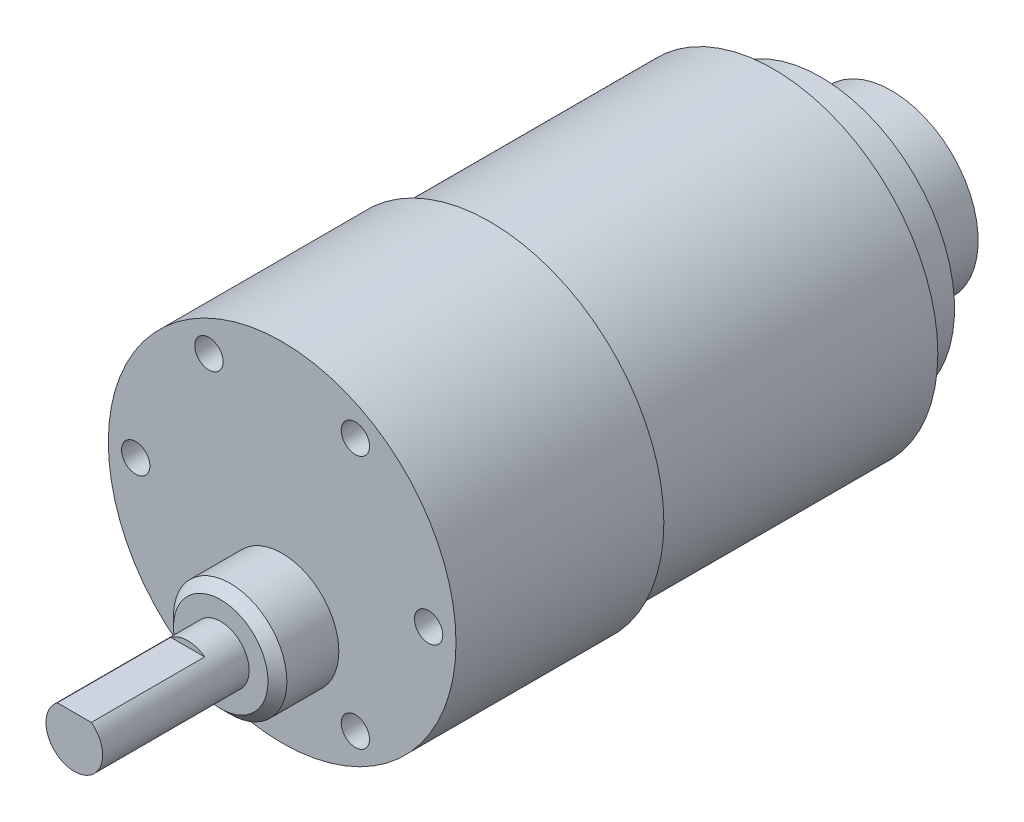
ISO-10303-21;
HEADER;
FILE_DESCRIPTION(('STEP AP214'),'2;1');
FILE_NAME('part.step','',(''),(''),'','','');
FILE_SCHEMA(('AUTOMOTIVE_DESIGN { 1 0 10303 214 1 1 1 1 }'));
ENDSEC;
DATA;
#1=APPLICATION_CONTEXT('core data for automotive mechanical design processes');
#2=APPLICATION_PROTOCOL_DEFINITION('international standard','automotive_design',2000,#1);
#3=PRODUCT_CONTEXT('',#1,'mechanical');
#4=PRODUCT('Part','Part','',(#3));
#5=PRODUCT_RELATED_PRODUCT_CATEGORY('part','',(#4));
#6=PRODUCT_DEFINITION_FORMATION('','',#4);
#7=PRODUCT_DEFINITION_CONTEXT('part definition',#1,'design');
#8=PRODUCT_DEFINITION('design','',#6,#7);
#9=PRODUCT_DEFINITION_SHAPE('','',#8);
#10=(LENGTH_UNIT() NAMED_UNIT(*) SI_UNIT(.MILLI.,.METRE.));
#11=(NAMED_UNIT(*) PLANE_ANGLE_UNIT() SI_UNIT($,.RADIAN.));
#12=(NAMED_UNIT(*) SI_UNIT($,.STERADIAN.) SOLID_ANGLE_UNIT());
#13=UNCERTAINTY_MEASURE_WITH_UNIT(LENGTH_MEASURE(1.E-05),#10,'distance_accuracy_value','');
#14=(GEOMETRIC_REPRESENTATION_CONTEXT(3) GLOBAL_UNCERTAINTY_ASSIGNED_CONTEXT((#13)) GLOBAL_UNIT_ASSIGNED_CONTEXT((#10,
#11,#12)) REPRESENTATION_CONTEXT('',''));
#15=CARTESIAN_POINT('',(0.,0.,0.));
#16=DIRECTION('',(0.,0.,1.));
#17=DIRECTION('',(1.,0.,0.));
#18=AXIS2_PLACEMENT_3D('',#15,#16,#17);
#19=CARTESIAN_POINT('',(0.,0.,-30.));
#20=DIRECTION('',(0.,0.,-1.));
#21=DIRECTION('',(-1.,0.,0.));
#22=AXIS2_PLACEMENT_3D('',#19,#20,#21);
#23=PLANE('',#22);
#24=CARTESIAN_POINT('',(0.,0.,-30.));
#25=DIRECTION('',(0.,0.,-1.));
#26=DIRECTION('',(-1.,0.,0.));
#27=AXIS2_PLACEMENT_3D('',#24,#25,#26);
#28=CIRCLE('',#27,17.4);
#29=CARTESIAN_POINT('',(-17.4,0.,-30.));
#30=VERTEX_POINT('',#29);
#31=EDGE_CURVE('E78',#30,#30,#28,.T.);
#32=ORIENTED_EDGE('',*,*,#31,.T.);
#33=EDGE_LOOP('',(#32));
#34=FACE_BOUND('',#33,.T.);
#35=CARTESIAN_POINT('',(0.,0.,-30.));
#36=DIRECTION('',(0.,0.,-1.));
#37=DIRECTION('',(-1.,0.,0.));
#38=AXIS2_PLACEMENT_3D('',#35,#36,#37);
#39=CIRCLE('',#38,14.1682647847948);
#40=CARTESIAN_POINT('',(-14.1682647847948,0.,-30.));
#41=VERTEX_POINT('',#40);
#42=EDGE_CURVE('E398',#41,#41,#39,.T.);
#43=ORIENTED_EDGE('',*,*,#42,.F.);
#44=EDGE_LOOP('',(#43));
#45=FACE_BOUND('',#44,.T.);
#46=ADVANCED_FACE('F35',(#34,#45),#23,.T.);
#47=CARTESIAN_POINT('',(0.,-7.,44.));
#48=DIRECTION('',(0.,0.,-1.));
#49=DIRECTION('',(-1.,0.,0.));
#50=AXIS2_PLACEMENT_3D('',#47,#48,#49);
#51=CYLINDRICAL_SURFACE('',#50,3.);
#52=CARTESIAN_POINT('',(0.,-7.,28.5));
#53=DIRECTION('',(0.,0.,1.));
#54=DIRECTION('',(1.,0.,0.));
#55=AXIS2_PLACEMENT_3D('',#52,#53,#54);
#56=CIRCLE('',#55,3.);
#57=CARTESIAN_POINT('',(3.,-7.,28.5));
#58=VERTEX_POINT('',#57);
#59=EDGE_CURVE('E72',#58,#58,#56,.T.);
#60=ORIENTED_EDGE('',*,*,#59,.T.);
#61=EDGE_LOOP('',(#60));
#62=FACE_BOUND('',#61,.T.);
#63=DIRECTION('',(0.,0.,-1.));
#64=VECTOR('',#63,1.);
#65=CARTESIAN_POINT('',(1.8,-4.6,44.));
#66=LINE('',#65,#64);
#67=CARTESIAN_POINT('',(1.8,-4.6,44.));
#68=VERTEX_POINT('',#67);
#69=CARTESIAN_POINT('',(1.8,-4.6,32.));
#70=VERTEX_POINT('',#69);
#71=EDGE_CURVE('E63',#68,#70,#66,.T.);
#72=ORIENTED_EDGE('',*,*,#71,.F.);
#73=CARTESIAN_POINT('',(0.,-7.,44.));
#74=DIRECTION('',(0.,0.,1.));
#75=DIRECTION('',(1.,0.,0.));
#76=AXIS2_PLACEMENT_3D('',#73,#74,#75);
#77=CIRCLE('',#76,3.);
#78=CARTESIAN_POINT('',(-1.8,-4.6,44.));
#79=VERTEX_POINT('',#78);
#80=EDGE_CURVE('E71',#79,#68,#77,.T.);
#81=ORIENTED_EDGE('',*,*,#80,.F.);
#82=DIRECTION('',(0.,0.,-1.));
#83=VECTOR('',#82,1.);
#84=CARTESIAN_POINT('',(-1.8,-4.6,44.));
#85=LINE('',#84,#83);
#86=CARTESIAN_POINT('',(-1.8,-4.6,32.));
#87=VERTEX_POINT('',#86);
#88=EDGE_CURVE('E51',#87,#79,#85,.F.);
#89=ORIENTED_EDGE('',*,*,#88,.F.);
#90=CARTESIAN_POINT('',(0.,-7.,32.));
#91=DIRECTION('',(0.,0.,1.));
#92=DIRECTION('',(1.,0.,0.));
#93=AXIS2_PLACEMENT_3D('',#90,#91,#92);
#94=CIRCLE('',#93,3.);
#95=EDGE_CURVE('E11',#70,#87,#94,.T.);
#96=ORIENTED_EDGE('',*,*,#95,.F.);
#97=EDGE_LOOP('',(#72,#81,#89,#96));
#98=FACE_BOUND('',#97,.T.);
#99=ADVANCED_FACE('F70',(#62,#98),#51,.T.);
#100=CARTESIAN_POINT('',(0.,-7.,44.));
#101=DIRECTION('',(0.,0.,1.));
#102=DIRECTION('',(1.,0.,0.));
#103=AXIS2_PLACEMENT_3D('',#100,#101,#102);
#104=PLANE('',#103);
#105=ORIENTED_EDGE('',*,*,#80,.T.);
#106=DIRECTION('',(-1.,0.,0.));
#107=VECTOR('',#106,1.);
#108=CARTESIAN_POINT('',(0.,-4.6,44.));
#109=LINE('',#108,#107);
#110=EDGE_CURVE('E44',#68,#79,#109,.T.);
#111=ORIENTED_EDGE('',*,*,#110,.T.);
#112=EDGE_LOOP('',(#105,#111));
#113=FACE_BOUND('',#112,.T.);
#114=ADVANCED_FACE('F74',(#113),#104,.T.);
#115=CARTESIAN_POINT('',(0.,-7.,28.5));
#116=DIRECTION('',(0.,0.,1.));
#117=DIRECTION('',(1.,0.,0.));
#118=AXIS2_PLACEMENT_3D('',#115,#116,#117);
#119=PLANE('',#118);
#120=CARTESIAN_POINT('',(0.,-7.,28.5));
#121=DIRECTION('',(0.,0.,1.));
#122=DIRECTION('',(1.,0.,0.));
#123=AXIS2_PLACEMENT_3D('',#120,#121,#122);
#124=CIRCLE('',#123,5.00000000000005);
#125=CARTESIAN_POINT('',(5.00000000000005,-7.,28.5));
#126=VERTEX_POINT('',#125);
#127=EDGE_CURVE('E95',#126,#126,#124,.T.);
#128=ORIENTED_EDGE('',*,*,#127,.T.);
#129=EDGE_LOOP('',(#128));
#130=FACE_BOUND('',#129,.T.);
#131=ORIENTED_EDGE('',*,*,#59,.F.);
#132=EDGE_LOOP('',(#131));
#133=FACE_BOUND('',#132,.T.);
#134=ADVANCED_FACE('F109',(#130,#133),#119,.T.);
#135=CARTESIAN_POINT('',(0.,0.,22.));
#136=DIRECTION('',(0.,0.,1.));
#137=DIRECTION('',(1.,0.,0.));
#138=AXIS2_PLACEMENT_3D('',#135,#136,#137);
#139=PLANE('',#138);
#140=CARTESIAN_POINT('',(7.75,-13.4233937586588,22.));
#141=DIRECTION('',(0.,0.,1.));
#142=DIRECTION('',(1.,0.,0.));
#143=AXIS2_PLACEMENT_3D('',#140,#141,#142);
#144=CIRCLE('',#143,1.5);
#145=CARTESIAN_POINT('',(9.25,-13.4233937586588,22.));
#146=VERTEX_POINT('',#145);
#147=EDGE_CURVE('E390',#146,#146,#144,.T.);
#148=ORIENTED_EDGE('',*,*,#147,.F.);
#149=EDGE_LOOP('',(#148));
#150=FACE_BOUND('',#149,.T.);
#151=CARTESIAN_POINT('',(-7.75,-13.4233937586588,22.));
#152=DIRECTION('',(0.,0.,1.));
#153=DIRECTION('',(1.,0.,0.));
#154=AXIS2_PLACEMENT_3D('',#151,#152,#153);
#155=CIRCLE('',#154,1.5);
#156=CARTESIAN_POINT('',(-6.25,-13.4233937586588,22.));
#157=VERTEX_POINT('',#156);
#158=EDGE_CURVE('E401',#157,#157,#155,.T.);
#159=ORIENTED_EDGE('',*,*,#158,.F.);
#160=EDGE_LOOP('',(#159));
#161=FACE_BOUND('',#160,.T.);
#162=CARTESIAN_POINT('',(-15.5,0.,22.));
#163=DIRECTION('',(0.,0.,1.));
#164=DIRECTION('',(1.,0.,0.));
#165=AXIS2_PLACEMENT_3D('',#162,#163,#164);
#166=CIRCLE('',#165,1.5);
#167=CARTESIAN_POINT('',(-14.,0.,22.));
#168=VERTEX_POINT('',#167);
#169=EDGE_CURVE('E406',#168,#168,#166,.T.);
#170=ORIENTED_EDGE('',*,*,#169,.F.);
#171=EDGE_LOOP('',(#170));
#172=FACE_BOUND('',#171,.T.);
#173=CARTESIAN_POINT('',(15.5,0.,22.));
#174=DIRECTION('',(0.,0.,1.));
#175=DIRECTION('',(1.,0.,0.));
#176=AXIS2_PLACEMENT_3D('',#173,#174,#175);
#177=CIRCLE('',#176,1.5);
#178=CARTESIAN_POINT('',(17.,0.,22.));
#179=VERTEX_POINT('',#178);
#180=EDGE_CURVE('E412',#179,#179,#177,.T.);
#181=ORIENTED_EDGE('',*,*,#180,.F.);
#182=EDGE_LOOP('',(#181));
#183=FACE_BOUND('',#182,.T.);
#184=CARTESIAN_POINT('',(7.75,13.4233937586588,22.));
#185=DIRECTION('',(0.,0.,1.));
#186=DIRECTION('',(1.,0.,0.));
#187=AXIS2_PLACEMENT_3D('',#184,#185,#186);
#188=CIRCLE('',#187,1.5);
#189=CARTESIAN_POINT('',(9.25,13.4233937586588,22.));
#190=VERTEX_POINT('',#189);
#191=EDGE_CURVE('E418',#190,#190,#188,.T.);
#192=ORIENTED_EDGE('',*,*,#191,.F.);
#193=EDGE_LOOP('',(#192));
#194=FACE_BOUND('',#193,.T.);
#195=CARTESIAN_POINT('',(-7.75,13.4233937586588,22.));
#196=DIRECTION('',(0.,0.,1.));
#197=DIRECTION('',(1.,0.,0.));
#198=AXIS2_PLACEMENT_3D('',#195,#196,#197);
#199=CIRCLE('',#198,1.5);
#200=CARTESIAN_POINT('',(-6.25,13.4233937586588,22.));
#201=VERTEX_POINT('',#200);
#202=EDGE_CURVE('E424',#201,#201,#199,.T.);
#203=ORIENTED_EDGE('',*,*,#202,.F.);
#204=EDGE_LOOP('',(#203));
#205=FACE_BOUND('',#204,.T.);
#206=CARTESIAN_POINT('',(0.,0.,22.));
#207=DIRECTION('',(0.,0.,1.));
#208=DIRECTION('',(1.,0.,0.));
#209=AXIS2_PLACEMENT_3D('',#206,#207,#208);
#210=CIRCLE('',#209,18.4);
#211=CARTESIAN_POINT('',(18.4,0.,22.));
#212=VERTEX_POINT('',#211);
#213=EDGE_CURVE('E87',#212,#212,#210,.T.);
#214=ORIENTED_EDGE('',*,*,#213,.T.);
#215=EDGE_LOOP('',(#214));
#216=FACE_BOUND('',#215,.T.);
#217=CARTESIAN_POINT('',(0.,-7.,22.));
#218=DIRECTION('',(0.,0.,1.));
#219=DIRECTION('',(1.,0.,0.));
#220=AXIS2_PLACEMENT_3D('',#217,#218,#219);
#221=CIRCLE('',#220,6.);
#222=CARTESIAN_POINT('',(6.,-7.,22.));
#223=VERTEX_POINT('',#222);
#224=EDGE_CURVE('E75',#223,#223,#221,.T.);
#225=ORIENTED_EDGE('',*,*,#224,.F.);
#226=EDGE_LOOP('',(#225));
#227=FACE_BOUND('',#226,.T.);
#228=ADVANCED_FACE('F112',(#150,#161,#172,#183,#194,#205,#216,#227),#139,.T.);
#229=CARTESIAN_POINT('',(0.,0.,0.));
#230=DIRECTION('',(0.,0.,1.));
#231=DIRECTION('',(1.,0.,0.));
#232=AXIS2_PLACEMENT_3D('',#229,#230,#231);
#233=PLANE('',#232);
#234=CARTESIAN_POINT('',(0.,0.,0.));
#235=DIRECTION('',(0.,0.,1.));
#236=DIRECTION('',(1.,0.,0.));
#237=AXIS2_PLACEMENT_3D('',#234,#235,#236);
#238=CIRCLE('',#237,18.4);
#239=CARTESIAN_POINT('',(18.4,0.,0.));
#240=VERTEX_POINT('',#239);
#241=EDGE_CURVE('E86',#240,#240,#238,.T.);
#242=ORIENTED_EDGE('',*,*,#241,.F.);
#243=EDGE_LOOP('',(#242));
#244=FACE_BOUND('',#243,.T.);
#245=CARTESIAN_POINT('',(0.,0.,0.));
#246=DIRECTION('',(0.,0.,1.));
#247=DIRECTION('',(1.,0.,0.));
#248=AXIS2_PLACEMENT_3D('',#245,#246,#247);
#249=CIRCLE('',#248,17.4);
#250=CARTESIAN_POINT('',(17.4,0.,0.));
#251=VERTEX_POINT('',#250);
#252=EDGE_CURVE('E90',#251,#251,#249,.F.);
#253=ORIENTED_EDGE('',*,*,#252,.F.);
#254=EDGE_LOOP('',(#253));
#255=FACE_BOUND('',#254,.T.);
#256=ADVANCED_FACE('F136',(#244,#255),#233,.F.);
#257=CARTESIAN_POINT('',(0.,0.,22.));
#258=DIRECTION('',(0.,0.,-1.));
#259=DIRECTION('',(-1.,0.,0.));
#260=AXIS2_PLACEMENT_3D('',#257,#258,#259);
#261=CYLINDRICAL_SURFACE('',#260,18.4);
#262=ORIENTED_EDGE('',*,*,#213,.F.);
#263=EDGE_LOOP('',(#262));
#264=FACE_BOUND('',#263,.T.);
#265=ORIENTED_EDGE('',*,*,#241,.T.);
#266=EDGE_LOOP('',(#265));
#267=FACE_BOUND('',#266,.T.);
#268=ADVANCED_FACE('F132',(#264,#267),#261,.T.);
#269=CARTESIAN_POINT('',(0.,0.,-30.));
#270=DIRECTION('',(0.,0.,1.));
#271=DIRECTION('',(1.,0.,0.));
#272=AXIS2_PLACEMENT_3D('',#269,#270,#271);
#273=CYLINDRICAL_SURFACE('',#272,17.4);
#274=ORIENTED_EDGE('',*,*,#31,.F.);
#275=EDGE_LOOP('',(#274));
#276=FACE_BOUND('',#275,.T.);
#277=ORIENTED_EDGE('',*,*,#252,.T.);
#278=EDGE_LOOP('',(#277));
#279=FACE_BOUND('',#278,.T.);
#280=ADVANCED_FACE('F128',(#276,#279),#273,.T.);
#281=CARTESIAN_POINT('',(0.,-7.,28.5));
#282=DIRECTION('',(0.,0.,-1.));
#283=DIRECTION('',(-1.,0.,0.));
#284=AXIS2_PLACEMENT_3D('',#281,#282,#283);
#285=CYLINDRICAL_SURFACE('',#284,6.);
#286=CARTESIAN_POINT('',(0.,-7.,27.5));
#287=DIRECTION('',(0.,0.,1.));
#288=DIRECTION('',(1.,0.,0.));
#289=AXIS2_PLACEMENT_3D('',#286,#287,#288);
#290=CIRCLE('',#289,6.);
#291=CARTESIAN_POINT('',(6.,-7.,27.5));
#292=VERTEX_POINT('',#291);
#293=EDGE_CURVE('E67',#292,#292,#290,.F.);
#294=ORIENTED_EDGE('',*,*,#293,.T.);
#295=EDGE_LOOP('',(#294));
#296=FACE_BOUND('',#295,.T.);
#297=ORIENTED_EDGE('',*,*,#224,.T.);
#298=EDGE_LOOP('',(#297));
#299=FACE_BOUND('',#298,.T.);
#300=ADVANCED_FACE('F101',(#296,#299),#285,.T.);
#301=CARTESIAN_POINT('',(0.,-7.,28.5));
#302=DIRECTION('',(0.,0.,-1.));
#303=DIRECTION('',(-1.,0.,0.));
#304=AXIS2_PLACEMENT_3D('',#301,#302,#303);
#305=CONICAL_SURFACE('',#304,5.00000000000005,0.785398163397445);
#306=ORIENTED_EDGE('',*,*,#293,.F.);
#307=EDGE_LOOP('',(#306));
#308=FACE_BOUND('',#307,.T.);
#309=ORIENTED_EDGE('',*,*,#127,.F.);
#310=EDGE_LOOP('',(#309));
#311=FACE_BOUND('',#310,.T.);
#312=ADVANCED_FACE('F37',(#308,#311),#305,.T.);
#313=CARTESIAN_POINT('',(15.5,-4.,32.));
#314=DIRECTION('',(0.,0.,1.));
#315=DIRECTION('',(1.,0.,0.));
#316=AXIS2_PLACEMENT_3D('',#313,#314,#315);
#317=PLANE('',#316);
#318=DIRECTION('',(-1.,0.,0.));
#319=VECTOR('',#318,1.);
#320=CARTESIAN_POINT('',(15.5,-4.6,32.));
#321=LINE('',#320,#319);
#322=EDGE_CURVE('E430',#70,#87,#321,.T.);
#323=ORIENTED_EDGE('',*,*,#322,.F.);
#324=ORIENTED_EDGE('',*,*,#95,.T.);
#325=EDGE_LOOP('',(#323,#324));
#326=FACE_BOUND('',#325,.T.);
#327=ADVANCED_FACE('F106',(#326),#317,.T.);
#328=CARTESIAN_POINT('',(15.5,-4.6,44.));
#329=DIRECTION('',(0.,1.,0.));
#330=DIRECTION('',(0.,0.,1.));
#331=AXIS2_PLACEMENT_3D('',#328,#329,#330);
#332=PLANE('',#331);
#333=ORIENTED_EDGE('',*,*,#71,.T.);
#334=ORIENTED_EDGE('',*,*,#322,.T.);
#335=ORIENTED_EDGE('',*,*,#88,.T.);
#336=ORIENTED_EDGE('',*,*,#110,.F.);
#337=EDGE_LOOP('',(#333,#334,#335,#336));
#338=FACE_BOUND('',#337,.T.);
#339=ADVANCED_FACE('F62',(#338),#332,.T.);
#340=CARTESIAN_POINT('',(-7.75,13.4233937586588,17.));
#341=DIRECTION('',(0.,0.,1.));
#342=DIRECTION('',(1.,0.,0.));
#343=AXIS2_PLACEMENT_3D('',#340,#341,#342);
#344=CYLINDRICAL_SURFACE('',#343,1.5);
#345=CARTESIAN_POINT('',(-7.75,13.4233937586588,17.));
#346=DIRECTION('',(0.,0.,1.));
#347=DIRECTION('',(1.,0.,0.));
#348=AXIS2_PLACEMENT_3D('',#345,#346,#347);
#349=CIRCLE('',#348,1.5);
#350=CARTESIAN_POINT('',(-6.25,13.4233937586588,17.));
#351=VERTEX_POINT('',#350);
#352=EDGE_CURVE('E427',#351,#351,#349,.T.);
#353=ORIENTED_EDGE('',*,*,#352,.F.);
#354=EDGE_LOOP('',(#353));
#355=FACE_BOUND('',#354,.T.);
#356=ORIENTED_EDGE('',*,*,#202,.T.);
#357=EDGE_LOOP('',(#356));
#358=FACE_BOUND('',#357,.T.);
#359=ADVANCED_FACE('F181',(#355,#358),#344,.F.);
#360=CARTESIAN_POINT('',(-7.75,13.4233937586588,17.));
#361=DIRECTION('',(0.,0.,1.));
#362=DIRECTION('',(1.,0.,0.));
#363=AXIS2_PLACEMENT_3D('',#360,#361,#362);
#364=PLANE('',#363);
#365=ORIENTED_EDGE('',*,*,#352,.T.);
#366=EDGE_LOOP('',(#365));
#367=FACE_BOUND('',#366,.T.);
#368=ADVANCED_FACE('F188',(#367),#364,.T.);
#369=CARTESIAN_POINT('',(7.75,13.4233937586588,17.));
#370=DIRECTION('',(0.,0.,1.));
#371=DIRECTION('',(1.,0.,0.));
#372=AXIS2_PLACEMENT_3D('',#369,#370,#371);
#373=CYLINDRICAL_SURFACE('',#372,1.5);
#374=CARTESIAN_POINT('',(7.75,13.4233937586588,17.));
#375=DIRECTION('',(0.,0.,1.));
#376=DIRECTION('',(1.,0.,0.));
#377=AXIS2_PLACEMENT_3D('',#374,#375,#376);
#378=CIRCLE('',#377,1.5);
#379=CARTESIAN_POINT('',(9.25,13.4233937586588,17.));
#380=VERTEX_POINT('',#379);
#381=EDGE_CURVE('E421',#380,#380,#378,.T.);
#382=ORIENTED_EDGE('',*,*,#381,.F.);
#383=EDGE_LOOP('',(#382));
#384=FACE_BOUND('',#383,.T.);
#385=ORIENTED_EDGE('',*,*,#191,.T.);
#386=EDGE_LOOP('',(#385));
#387=FACE_BOUND('',#386,.T.);
#388=ADVANCED_FACE('F196',(#384,#387),#373,.F.);
#389=CARTESIAN_POINT('',(7.75,13.4233937586588,17.));
#390=DIRECTION('',(0.,0.,1.));
#391=DIRECTION('',(1.,0.,0.));
#392=AXIS2_PLACEMENT_3D('',#389,#390,#391);
#393=PLANE('',#392);
#394=ORIENTED_EDGE('',*,*,#381,.T.);
#395=EDGE_LOOP('',(#394));
#396=FACE_BOUND('',#395,.T.);
#397=ADVANCED_FACE('F204',(#396),#393,.T.);
#398=CARTESIAN_POINT('',(15.5,0.,17.));
#399=DIRECTION('',(0.,0.,1.));
#400=DIRECTION('',(1.,0.,0.));
#401=AXIS2_PLACEMENT_3D('',#398,#399,#400);
#402=CYLINDRICAL_SURFACE('',#401,1.5);
#403=CARTESIAN_POINT('',(15.5,0.,17.));
#404=DIRECTION('',(0.,0.,1.));
#405=DIRECTION('',(1.,0.,0.));
#406=AXIS2_PLACEMENT_3D('',#403,#404,#405);
#407=CIRCLE('',#406,1.5);
#408=CARTESIAN_POINT('',(17.,0.,17.));
#409=VERTEX_POINT('',#408);
#410=EDGE_CURVE('E415',#409,#409,#407,.T.);
#411=ORIENTED_EDGE('',*,*,#410,.F.);
#412=EDGE_LOOP('',(#411));
#413=FACE_BOUND('',#412,.T.);
#414=ORIENTED_EDGE('',*,*,#180,.T.);
#415=EDGE_LOOP('',(#414));
#416=FACE_BOUND('',#415,.T.);
#417=ADVANCED_FACE('F212',(#413,#416),#402,.F.);
#418=CARTESIAN_POINT('',(15.5,0.,17.));
#419=DIRECTION('',(0.,0.,1.));
#420=DIRECTION('',(1.,0.,0.));
#421=AXIS2_PLACEMENT_3D('',#418,#419,#420);
#422=PLANE('',#421);
#423=ORIENTED_EDGE('',*,*,#410,.T.);
#424=EDGE_LOOP('',(#423));
#425=FACE_BOUND('',#424,.T.);
#426=ADVANCED_FACE('F220',(#425),#422,.T.);
#427=CARTESIAN_POINT('',(-15.5,0.,17.));
#428=DIRECTION('',(0.,0.,1.));
#429=DIRECTION('',(1.,0.,0.));
#430=AXIS2_PLACEMENT_3D('',#427,#428,#429);
#431=CYLINDRICAL_SURFACE('',#430,1.5);
#432=CARTESIAN_POINT('',(-15.5,0.,17.));
#433=DIRECTION('',(0.,0.,1.));
#434=DIRECTION('',(1.,0.,0.));
#435=AXIS2_PLACEMENT_3D('',#432,#433,#434);
#436=CIRCLE('',#435,1.5);
#437=CARTESIAN_POINT('',(-14.,0.,17.));
#438=VERTEX_POINT('',#437);
#439=EDGE_CURVE('E409',#438,#438,#436,.T.);
#440=ORIENTED_EDGE('',*,*,#439,.F.);
#441=EDGE_LOOP('',(#440));
#442=FACE_BOUND('',#441,.T.);
#443=ORIENTED_EDGE('',*,*,#169,.T.);
#444=EDGE_LOOP('',(#443));
#445=FACE_BOUND('',#444,.T.);
#446=ADVANCED_FACE('F228',(#442,#445),#431,.F.);
#447=CARTESIAN_POINT('',(-15.5,0.,17.));
#448=DIRECTION('',(0.,0.,1.));
#449=DIRECTION('',(1.,0.,0.));
#450=AXIS2_PLACEMENT_3D('',#447,#448,#449);
#451=PLANE('',#450);
#452=ORIENTED_EDGE('',*,*,#439,.T.);
#453=EDGE_LOOP('',(#452));
#454=FACE_BOUND('',#453,.T.);
#455=ADVANCED_FACE('F236',(#454),#451,.T.);
#456=CARTESIAN_POINT('',(-7.75,-13.4233937586588,17.));
#457=DIRECTION('',(0.,0.,1.));
#458=DIRECTION('',(1.,0.,0.));
#459=AXIS2_PLACEMENT_3D('',#456,#457,#458);
#460=CYLINDRICAL_SURFACE('',#459,1.5);
#461=CARTESIAN_POINT('',(-7.75,-13.4233937586588,17.));
#462=DIRECTION('',(0.,0.,1.));
#463=DIRECTION('',(1.,0.,0.));
#464=AXIS2_PLACEMENT_3D('',#461,#462,#463);
#465=CIRCLE('',#464,1.5);
#466=CARTESIAN_POINT('',(-6.25,-13.4233937586588,17.));
#467=VERTEX_POINT('',#466);
#468=EDGE_CURVE('E403',#467,#467,#465,.T.);
#469=ORIENTED_EDGE('',*,*,#468,.F.);
#470=EDGE_LOOP('',(#469));
#471=FACE_BOUND('',#470,.T.);
#472=ORIENTED_EDGE('',*,*,#158,.T.);
#473=EDGE_LOOP('',(#472));
#474=FACE_BOUND('',#473,.T.);
#475=ADVANCED_FACE('F244',(#471,#474),#460,.F.);
#476=CARTESIAN_POINT('',(-7.75,-13.4233937586588,17.));
#477=DIRECTION('',(0.,0.,1.));
#478=DIRECTION('',(1.,0.,0.));
#479=AXIS2_PLACEMENT_3D('',#476,#477,#478);
#480=PLANE('',#479);
#481=ORIENTED_EDGE('',*,*,#468,.T.);
#482=EDGE_LOOP('',(#481));
#483=FACE_BOUND('',#482,.T.);
#484=ADVANCED_FACE('F252',(#483),#480,.T.);
#485=CARTESIAN_POINT('',(7.75,-13.4233937586588,17.));
#486=DIRECTION('',(0.,0.,1.));
#487=DIRECTION('',(1.,0.,0.));
#488=AXIS2_PLACEMENT_3D('',#485,#486,#487);
#489=CYLINDRICAL_SURFACE('',#488,1.5);
#490=CARTESIAN_POINT('',(7.75,-13.4233937586588,17.));
#491=DIRECTION('',(0.,0.,1.));
#492=DIRECTION('',(1.,0.,0.));
#493=AXIS2_PLACEMENT_3D('',#490,#491,#492);
#494=CIRCLE('',#493,1.5);
#495=CARTESIAN_POINT('',(9.25,-13.4233937586588,17.));
#496=VERTEX_POINT('',#495);
#497=EDGE_CURVE('E393',#496,#496,#494,.T.);
#498=ORIENTED_EDGE('',*,*,#497,.F.);
#499=EDGE_LOOP('',(#498));
#500=FACE_BOUND('',#499,.T.);
#501=ORIENTED_EDGE('',*,*,#147,.T.);
#502=EDGE_LOOP('',(#501));
#503=FACE_BOUND('',#502,.T.);
#504=ADVANCED_FACE('F260',(#500,#503),#489,.F.);
#505=CARTESIAN_POINT('',(7.75,-13.4233937586588,17.));
#506=DIRECTION('',(0.,0.,1.));
#507=DIRECTION('',(1.,0.,0.));
#508=AXIS2_PLACEMENT_3D('',#505,#506,#507);
#509=PLANE('',#508);
#510=ORIENTED_EDGE('',*,*,#497,.T.);
#511=EDGE_LOOP('',(#510));
#512=FACE_BOUND('',#511,.T.);
#513=ADVANCED_FACE('F268',(#512),#509,.T.);
#514=CARTESIAN_POINT('',(0.,0.,-35.));
#515=DIRECTION('',(0.,0.,-1.));
#516=DIRECTION('',(-1.,0.,0.));
#517=AXIS2_PLACEMENT_3D('',#514,#515,#516);
#518=PLANE('',#517);
#519=CARTESIAN_POINT('',(0.,0.,-35.));
#520=DIRECTION('',(0.,0.,-1.));
#521=DIRECTION('',(-1.,0.,0.));
#522=AXIS2_PLACEMENT_3D('',#519,#520,#521);
#523=CIRCLE('',#522,14.1682647847948);
#524=CARTESIAN_POINT('',(-14.1682647847948,0.,-35.));
#525=VERTEX_POINT('',#524);
#526=EDGE_CURVE('E395',#525,#525,#523,.T.);
#527=ORIENTED_EDGE('',*,*,#526,.T.);
#528=EDGE_LOOP('',(#527));
#529=FACE_BOUND('',#528,.T.);
#530=CARTESIAN_POINT('',(0.,0.,-35.));
#531=DIRECTION('',(0.,0.,-1.));
#532=DIRECTION('',(-1.,0.,0.));
#533=AXIS2_PLACEMENT_3D('',#530,#531,#532);
#534=CIRCLE('',#533,9.16826478479481);
#535=CARTESIAN_POINT('',(-9.16826478479481,0.,-35.));
#536=VERTEX_POINT('',#535);
#537=EDGE_CURVE('E39',#536,#536,#534,.T.);
#538=ORIENTED_EDGE('',*,*,#537,.F.);
#539=EDGE_LOOP('',(#538));
#540=FACE_BOUND('',#539,.T.);
#541=ADVANCED_FACE('F276',(#529,#540),#518,.T.);
#542=CARTESIAN_POINT('',(0.,0.,-35.));
#543=DIRECTION('',(0.,0.,1.));
#544=DIRECTION('',(1.,0.,0.));
#545=AXIS2_PLACEMENT_3D('',#542,#543,#544);
#546=CYLINDRICAL_SURFACE('',#545,14.1682647847948);
#547=ORIENTED_EDGE('',*,*,#526,.F.);
#548=EDGE_LOOP('',(#547));
#549=FACE_BOUND('',#548,.T.);
#550=ORIENTED_EDGE('',*,*,#42,.T.);
#551=EDGE_LOOP('',(#550));
#552=FACE_BOUND('',#551,.T.);
#553=ADVANCED_FACE('F285',(#549,#552),#546,.T.);
#554=CARTESIAN_POINT('',(0.,0.,-42.5));
#555=DIRECTION('',(0.,0.,-1.));
#556=DIRECTION('',(-1.,0.,0.));
#557=AXIS2_PLACEMENT_3D('',#554,#555,#556);
#558=PLANE('',#557);
#559=CARTESIAN_POINT('',(0.,0.,-42.5));
#560=DIRECTION('',(0.,0.,-1.));
#561=DIRECTION('',(-1.,0.,0.));
#562=AXIS2_PLACEMENT_3D('',#559,#560,#561);
#563=CIRCLE('',#562,9.16826478479481);
#564=CARTESIAN_POINT('',(-9.16826478479481,0.,-42.5));
#565=VERTEX_POINT('',#564);
#566=EDGE_CURVE('E389',#565,#565,#563,.T.);
#567=ORIENTED_EDGE('',*,*,#566,.T.);
#568=EDGE_LOOP('',(#567));
#569=FACE_BOUND('',#568,.T.);
#570=ADVANCED_FACE('F294',(#569),#558,.T.);
#571=CARTESIAN_POINT('',(0.,0.,-42.5));
#572=DIRECTION('',(0.,0.,1.));
#573=DIRECTION('',(1.,0.,0.));
#574=AXIS2_PLACEMENT_3D('',#571,#572,#573);
#575=CYLINDRICAL_SURFACE('',#574,9.16826478479481);
#576=ORIENTED_EDGE('',*,*,#537,.T.);
#577=EDGE_LOOP('',(#576));
#578=FACE_BOUND('',#577,.T.);
#579=ORIENTED_EDGE('',*,*,#566,.F.);
#580=EDGE_LOOP('',(#579));
#581=FACE_BOUND('',#580,.T.);
#582=ADVANCED_FACE('F302',(#578,#581),#575,.T.);
#583=CLOSED_SHELL('',(#46,#99,#114,#134,#228,#256,#268,#280,#300,#312,#327,#339,#359,#368,#388,
#397,#417,#426,#446,#455,#475,#484,#504,#513,#541,#553,#570,#582));
#584=MANIFOLD_SOLID_BREP('B2',#583);
#585=ADVANCED_BREP_SHAPE_REPRESENTATION('',(#18,#584),#14);
#586=SHAPE_DEFINITION_REPRESENTATION(#9,#585);
ENDSEC;
END-ISO-10303-21;
